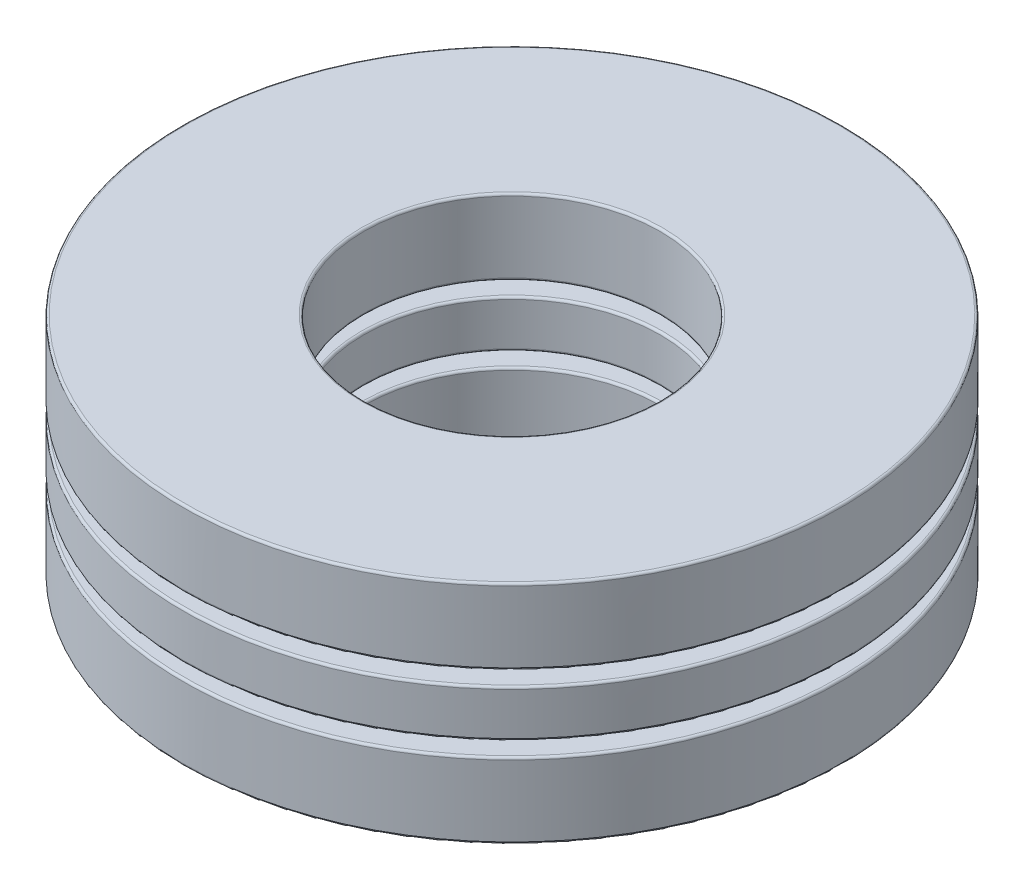
ISO-10303-21;
HEADER;
FILE_DESCRIPTION(('STEP AP214'),'2;1');
FILE_NAME('part.step','',(''),(''),'','','');
FILE_SCHEMA(('AUTOMOTIVE_DESIGN { 1 0 10303 214 1 1 1 1 }'));
ENDSEC;
DATA;
#1=APPLICATION_CONTEXT('core data for automotive mechanical design processes');
#2=APPLICATION_PROTOCOL_DEFINITION('international standard','automotive_design',2000,#1);
#3=PRODUCT_CONTEXT('',#1,'mechanical');
#4=PRODUCT('Part','Part','',(#3));
#5=PRODUCT_RELATED_PRODUCT_CATEGORY('part','',(#4));
#6=PRODUCT_DEFINITION_FORMATION('','',#4);
#7=PRODUCT_DEFINITION_CONTEXT('part definition',#1,'design');
#8=PRODUCT_DEFINITION('design','',#6,#7);
#9=PRODUCT_DEFINITION_SHAPE('','',#8);
#10=(LENGTH_UNIT() NAMED_UNIT(*) SI_UNIT(.MILLI.,.METRE.));
#11=(NAMED_UNIT(*) PLANE_ANGLE_UNIT() SI_UNIT($,.RADIAN.));
#12=(NAMED_UNIT(*) SI_UNIT($,.STERADIAN.) SOLID_ANGLE_UNIT());
#13=UNCERTAINTY_MEASURE_WITH_UNIT(LENGTH_MEASURE(1.E-05),#10,'distance_accuracy_value','');
#14=(GEOMETRIC_REPRESENTATION_CONTEXT(3) GLOBAL_UNCERTAINTY_ASSIGNED_CONTEXT((#13)) GLOBAL_UNIT_ASSIGNED_CONTEXT((#10,
#11,#12)) REPRESENTATION_CONTEXT('',''));
#15=CARTESIAN_POINT('',(0.,0.,0.));
#16=DIRECTION('',(0.,0.,1.));
#17=DIRECTION('',(1.,0.,0.));
#18=AXIS2_PLACEMENT_3D('',#15,#16,#17);
#19=CARTESIAN_POINT('',(0.,-2.4511,0.));
#20=DIRECTION('',(0.,-1.,0.));
#21=DIRECTION('',(0.,0.,-1.));
#22=AXIS2_PLACEMENT_3D('',#19,#20,#21);
#23=CYLINDRICAL_SURFACE('',#22,7.14375);
#24=CARTESIAN_POINT('',(0.,-2.402078,0.));
#25=DIRECTION('',(0.,1.,0.));
#26=DIRECTION('',(0.,0.,1.));
#27=AXIS2_PLACEMENT_3D('',#24,#25,#26);
#28=CIRCLE('',#27,7.14375);
#29=CARTESIAN_POINT('',(0.,-2.402078,7.14375));
#30=VERTEX_POINT('',#29);
#31=EDGE_CURVE('E11',#30,#30,#28,.T.);
#32=ORIENTED_EDGE('',*,*,#31,.T.);
#33=EDGE_LOOP('',(#32));
#34=FACE_BOUND('',#33,.T.);
#35=CARTESIAN_POINT('',(0.,-0.866055333333333,0.));
#36=DIRECTION('',(0.,-1.,0.));
#37=DIRECTION('',(0.,0.,-1.));
#38=AXIS2_PLACEMENT_3D('',#35,#36,#37);
#39=CIRCLE('',#38,7.14375);
#40=CARTESIAN_POINT('',(0.,-0.866055333333333,-7.14375));
#41=VERTEX_POINT('',#40);
#42=EDGE_CURVE('E49',#41,#41,#39,.T.);
#43=ORIENTED_EDGE('',*,*,#42,.T.);
#44=EDGE_LOOP('',(#43));
#45=FACE_BOUND('',#44,.T.);
#46=ADVANCED_FACE('F42',(#34,#45),#23,.T.);
#47=CARTESIAN_POINT('',(0.,-0.817033333333333,7.14375));
#48=DIRECTION('',(0.,-1.,0.));
#49=DIRECTION('',(0.,0.,-1.));
#50=AXIS2_PLACEMENT_3D('',#47,#48,#49);
#51=PLANE('',#50);
#52=CARTESIAN_POINT('',(0.,-0.817033333333333,0.));
#53=DIRECTION('',(0.,-1.,0.));
#54=DIRECTION('',(0.,0.,-1.));
#55=AXIS2_PLACEMENT_3D('',#52,#53,#54);
#56=CIRCLE('',#55,3.262122);
#57=CARTESIAN_POINT('',(0.,-0.817033333333333,-3.262122));
#58=VERTEX_POINT('',#57);
#59=EDGE_CURVE('E53',#58,#58,#56,.T.);
#60=ORIENTED_EDGE('',*,*,#59,.T.);
#61=EDGE_LOOP('',(#60));
#62=FACE_BOUND('',#61,.T.);
#63=CARTESIAN_POINT('',(0.,-0.817033333333333,0.));
#64=DIRECTION('',(0.,-1.,0.));
#65=DIRECTION('',(0.,0.,-1.));
#66=AXIS2_PLACEMENT_3D('',#63,#64,#65);
#67=CIRCLE('',#66,7.094728);
#68=CARTESIAN_POINT('',(0.,-0.817033333333333,-7.094728));
#69=VERTEX_POINT('',#68);
#70=EDGE_CURVE('E57',#69,#69,#67,.F.);
#71=ORIENTED_EDGE('',*,*,#70,.T.);
#72=EDGE_LOOP('',(#71));
#73=FACE_BOUND('',#72,.T.);
#74=ADVANCED_FACE('F85',(#62,#73),#51,.F.);
#75=CARTESIAN_POINT('',(0.,-2.4511,0.));
#76=DIRECTION('',(0.,-1.,0.));
#77=DIRECTION('',(0.,0.,-1.));
#78=AXIS2_PLACEMENT_3D('',#75,#76,#77);
#79=CYLINDRICAL_SURFACE('',#78,3.2131);
#80=CARTESIAN_POINT('',(0.,-2.402078,0.));
#81=DIRECTION('',(0.,1.,0.));
#82=DIRECTION('',(0.,0.,1.));
#83=AXIS2_PLACEMENT_3D('',#80,#81,#82);
#84=CIRCLE('',#83,3.2131);
#85=CARTESIAN_POINT('',(0.,-2.402078,3.2131));
#86=VERTEX_POINT('',#85);
#87=EDGE_CURVE('E68',#86,#86,#84,.F.);
#88=ORIENTED_EDGE('',*,*,#87,.T.);
#89=EDGE_LOOP('',(#88));
#90=FACE_BOUND('',#89,.T.);
#91=CARTESIAN_POINT('',(0.,-0.866055333333333,0.));
#92=DIRECTION('',(0.,-1.,0.));
#93=DIRECTION('',(0.,0.,-1.));
#94=AXIS2_PLACEMENT_3D('',#91,#92,#93);
#95=CIRCLE('',#94,3.2131);
#96=CARTESIAN_POINT('',(0.,-0.866055333333333,-3.2131));
#97=VERTEX_POINT('',#96);
#98=EDGE_CURVE('E71',#97,#97,#95,.F.);
#99=ORIENTED_EDGE('',*,*,#98,.T.);
#100=EDGE_LOOP('',(#99));
#101=FACE_BOUND('',#100,.T.);
#102=ADVANCED_FACE('F75',(#90,#101),#79,.F.);
#103=CARTESIAN_POINT('',(0.,-2.4511,7.14375));
#104=DIRECTION('',(0.,1.,0.));
#105=DIRECTION('',(0.,0.,1.));
#106=AXIS2_PLACEMENT_3D('',#103,#104,#105);
#107=PLANE('',#106);
#108=CARTESIAN_POINT('',(0.,-2.4511,0.));
#109=DIRECTION('',(0.,1.,0.));
#110=DIRECTION('',(0.,0.,1.));
#111=AXIS2_PLACEMENT_3D('',#108,#109,#110);
#112=CIRCLE('',#111,3.262122);
#113=CARTESIAN_POINT('',(0.,-2.4511,3.262122));
#114=VERTEX_POINT('',#113);
#115=EDGE_CURVE('E62',#114,#114,#112,.T.);
#116=ORIENTED_EDGE('',*,*,#115,.T.);
#117=EDGE_LOOP('',(#116));
#118=FACE_BOUND('',#117,.T.);
#119=CARTESIAN_POINT('',(0.,-2.4511,0.));
#120=DIRECTION('',(0.,1.,0.));
#121=DIRECTION('',(0.,0.,1.));
#122=AXIS2_PLACEMENT_3D('',#119,#120,#121);
#123=CIRCLE('',#122,7.094728);
#124=CARTESIAN_POINT('',(0.,-2.4511,7.094728));
#125=VERTEX_POINT('',#124);
#126=EDGE_CURVE('E65',#125,#125,#123,.F.);
#127=ORIENTED_EDGE('',*,*,#126,.T.);
#128=EDGE_LOOP('',(#127));
#129=FACE_BOUND('',#128,.T.);
#130=ADVANCED_FACE('F104',(#118,#129),#107,.F.);
#131=CARTESIAN_POINT('',(0.,-2.402078,0.));
#132=DIRECTION('',(0.,1.,0.));
#133=DIRECTION('',(0.,0.,1.));
#134=AXIS2_PLACEMENT_3D('',#131,#132,#133);
#135=TOROIDAL_SURFACE('',#134,3.262122,0.049022);
#136=ORIENTED_EDGE('',*,*,#115,.F.);
#137=EDGE_LOOP('',(#136));
#138=FACE_BOUND('',#137,.T.);
#139=ORIENTED_EDGE('',*,*,#87,.F.);
#140=EDGE_LOOP('',(#139));
#141=FACE_BOUND('',#140,.T.);
#142=ADVANCED_FACE('F81',(#138,#141),#135,.T.);
#143=CARTESIAN_POINT('',(0.,-0.866055333333333,0.));
#144=DIRECTION('',(0.,-1.,0.));
#145=DIRECTION('',(0.,0.,-1.));
#146=AXIS2_PLACEMENT_3D('',#143,#144,#145);
#147=TOROIDAL_SURFACE('',#146,3.262122,0.049022);
#148=ORIENTED_EDGE('',*,*,#98,.F.);
#149=EDGE_LOOP('',(#148));
#150=FACE_BOUND('',#149,.T.);
#151=ORIENTED_EDGE('',*,*,#59,.F.);
#152=EDGE_LOOP('',(#151));
#153=FACE_BOUND('',#152,.T.);
#154=ADVANCED_FACE('F77',(#150,#153),#147,.T.);
#155=CARTESIAN_POINT('',(0.,-2.402078,0.));
#156=DIRECTION('',(0.,1.,0.));
#157=DIRECTION('',(0.,0.,1.));
#158=AXIS2_PLACEMENT_3D('',#155,#156,#157);
#159=TOROIDAL_SURFACE('',#158,7.094728,0.049022);
#160=ORIENTED_EDGE('',*,*,#31,.F.);
#161=EDGE_LOOP('',(#160));
#162=FACE_BOUND('',#161,.T.);
#163=ORIENTED_EDGE('',*,*,#126,.F.);
#164=EDGE_LOOP('',(#163));
#165=FACE_BOUND('',#164,.T.);
#166=ADVANCED_FACE('F80',(#162,#165),#159,.T.);
#167=CARTESIAN_POINT('',(0.,-0.866055333333333,0.));
#168=DIRECTION('',(0.,-1.,0.));
#169=DIRECTION('',(0.,0.,-1.));
#170=AXIS2_PLACEMENT_3D('',#167,#168,#169);
#171=TOROIDAL_SURFACE('',#170,7.094728,0.049022);
#172=ORIENTED_EDGE('',*,*,#70,.F.);
#173=EDGE_LOOP('',(#172));
#174=FACE_BOUND('',#173,.T.);
#175=ORIENTED_EDGE('',*,*,#42,.F.);
#176=EDGE_LOOP('',(#175));
#177=FACE_BOUND('',#176,.T.);
#178=ADVANCED_FACE('F44',(#174,#177),#171,.T.);
#179=CLOSED_SHELL('',(#46,#74,#102,#130,#142,#154,#166,#178));
#180=MANIFOLD_SOLID_BREP('B2',#179);
#181=CARTESIAN_POINT('',(0.,-2.4511,0.));
#182=DIRECTION('',(0.,-1.,0.));
#183=DIRECTION('',(0.,0.,-1.));
#184=AXIS2_PLACEMENT_3D('',#181,#182,#183);
#185=CYLINDRICAL_SURFACE('',#184,7.14375);
#186=CARTESIAN_POINT('',(0.,0.866055333333334,0.));
#187=DIRECTION('',(0.,1.,0.));
#188=DIRECTION('',(0.,0.,1.));
#189=AXIS2_PLACEMENT_3D('',#186,#187,#188);
#190=CIRCLE('',#189,7.14375);
#191=CARTESIAN_POINT('',(0.,0.866055333333334,7.14375));
#192=VERTEX_POINT('',#191);
#193=EDGE_CURVE('E41',#192,#192,#190,.T.);
#194=ORIENTED_EDGE('',*,*,#193,.T.);
#195=EDGE_LOOP('',(#194));
#196=FACE_BOUND('',#195,.T.);
#197=CARTESIAN_POINT('',(0.,2.402078,0.));
#198=DIRECTION('',(0.,-1.,0.));
#199=DIRECTION('',(0.,0.,-1.));
#200=AXIS2_PLACEMENT_3D('',#197,#198,#199);
#201=CIRCLE('',#200,7.14375);
#202=CARTESIAN_POINT('',(0.,2.402078,-7.14375));
#203=VERTEX_POINT('',#202);
#204=EDGE_CURVE('E177',#203,#203,#201,.T.);
#205=ORIENTED_EDGE('',*,*,#204,.T.);
#206=EDGE_LOOP('',(#205));
#207=FACE_BOUND('',#206,.T.);
#208=ADVANCED_FACE('F170',(#196,#207),#185,.T.);
#209=CARTESIAN_POINT('',(0.,2.4511,7.14375));
#210=DIRECTION('',(0.,-1.,0.));
#211=DIRECTION('',(0.,0.,-1.));
#212=AXIS2_PLACEMENT_3D('',#209,#210,#211);
#213=PLANE('',#212);
#214=CARTESIAN_POINT('',(0.,2.4511,0.));
#215=DIRECTION('',(0.,-1.,0.));
#216=DIRECTION('',(0.,0.,-1.));
#217=AXIS2_PLACEMENT_3D('',#214,#215,#216);
#218=CIRCLE('',#217,3.262122);
#219=CARTESIAN_POINT('',(0.,2.4511,-3.262122));
#220=VERTEX_POINT('',#219);
#221=EDGE_CURVE('E181',#220,#220,#218,.T.);
#222=ORIENTED_EDGE('',*,*,#221,.T.);
#223=EDGE_LOOP('',(#222));
#224=FACE_BOUND('',#223,.T.);
#225=CARTESIAN_POINT('',(0.,2.4511,0.));
#226=DIRECTION('',(0.,-1.,0.));
#227=DIRECTION('',(0.,0.,-1.));
#228=AXIS2_PLACEMENT_3D('',#225,#226,#227);
#229=CIRCLE('',#228,7.094728);
#230=CARTESIAN_POINT('',(0.,2.4511,-7.094728));
#231=VERTEX_POINT('',#230);
#232=EDGE_CURVE('E185',#231,#231,#229,.F.);
#233=ORIENTED_EDGE('',*,*,#232,.T.);
#234=EDGE_LOOP('',(#233));
#235=FACE_BOUND('',#234,.T.);
#236=ADVANCED_FACE('F213',(#224,#235),#213,.F.);
#237=CARTESIAN_POINT('',(0.,-2.4511,0.));
#238=DIRECTION('',(0.,-1.,0.));
#239=DIRECTION('',(0.,0.,-1.));
#240=AXIS2_PLACEMENT_3D('',#237,#238,#239);
#241=CYLINDRICAL_SURFACE('',#240,3.2131);
#242=CARTESIAN_POINT('',(0.,0.866055333333334,0.));
#243=DIRECTION('',(0.,1.,0.));
#244=DIRECTION('',(0.,0.,1.));
#245=AXIS2_PLACEMENT_3D('',#242,#243,#244);
#246=CIRCLE('',#245,3.2131);
#247=CARTESIAN_POINT('',(0.,0.866055333333334,3.2131));
#248=VERTEX_POINT('',#247);
#249=EDGE_CURVE('E196',#248,#248,#246,.F.);
#250=ORIENTED_EDGE('',*,*,#249,.T.);
#251=EDGE_LOOP('',(#250));
#252=FACE_BOUND('',#251,.T.);
#253=CARTESIAN_POINT('',(0.,2.402078,0.));
#254=DIRECTION('',(0.,-1.,0.));
#255=DIRECTION('',(0.,0.,-1.));
#256=AXIS2_PLACEMENT_3D('',#253,#254,#255);
#257=CIRCLE('',#256,3.2131);
#258=CARTESIAN_POINT('',(0.,2.402078,-3.2131));
#259=VERTEX_POINT('',#258);
#260=EDGE_CURVE('E199',#259,#259,#257,.F.);
#261=ORIENTED_EDGE('',*,*,#260,.T.);
#262=EDGE_LOOP('',(#261));
#263=FACE_BOUND('',#262,.T.);
#264=ADVANCED_FACE('F203',(#252,#263),#241,.F.);
#265=CARTESIAN_POINT('',(0.,0.817033333333334,7.14375));
#266=DIRECTION('',(0.,1.,0.));
#267=DIRECTION('',(0.,0.,1.));
#268=AXIS2_PLACEMENT_3D('',#265,#266,#267);
#269=PLANE('',#268);
#270=CARTESIAN_POINT('',(0.,0.817033333333334,0.));
#271=DIRECTION('',(0.,1.,0.));
#272=DIRECTION('',(0.,0.,1.));
#273=AXIS2_PLACEMENT_3D('',#270,#271,#272);
#274=CIRCLE('',#273,3.262122);
#275=CARTESIAN_POINT('',(0.,0.817033333333334,3.262122));
#276=VERTEX_POINT('',#275);
#277=EDGE_CURVE('E190',#276,#276,#274,.T.);
#278=ORIENTED_EDGE('',*,*,#277,.T.);
#279=EDGE_LOOP('',(#278));
#280=FACE_BOUND('',#279,.T.);
#281=CARTESIAN_POINT('',(0.,0.817033333333334,0.));
#282=DIRECTION('',(0.,1.,0.));
#283=DIRECTION('',(0.,0.,1.));
#284=AXIS2_PLACEMENT_3D('',#281,#282,#283);
#285=CIRCLE('',#284,7.094728);
#286=CARTESIAN_POINT('',(0.,0.817033333333334,7.094728));
#287=VERTEX_POINT('',#286);
#288=EDGE_CURVE('E193',#287,#287,#285,.F.);
#289=ORIENTED_EDGE('',*,*,#288,.T.);
#290=EDGE_LOOP('',(#289));
#291=FACE_BOUND('',#290,.T.);
#292=ADVANCED_FACE('F232',(#280,#291),#269,.F.);
#293=CARTESIAN_POINT('',(0.,0.866055333333334,0.));
#294=DIRECTION('',(0.,1.,0.));
#295=DIRECTION('',(0.,0.,1.));
#296=AXIS2_PLACEMENT_3D('',#293,#294,#295);
#297=TOROIDAL_SURFACE('',#296,3.262122,0.049022);
#298=ORIENTED_EDGE('',*,*,#277,.F.);
#299=EDGE_LOOP('',(#298));
#300=FACE_BOUND('',#299,.T.);
#301=ORIENTED_EDGE('',*,*,#249,.F.);
#302=EDGE_LOOP('',(#301));
#303=FACE_BOUND('',#302,.T.);
#304=ADVANCED_FACE('F209',(#300,#303),#297,.T.);
#305=CARTESIAN_POINT('',(0.,2.402078,0.));
#306=DIRECTION('',(0.,-1.,0.));
#307=DIRECTION('',(0.,0.,-1.));
#308=AXIS2_PLACEMENT_3D('',#305,#306,#307);
#309=TOROIDAL_SURFACE('',#308,3.262122,0.049022);
#310=ORIENTED_EDGE('',*,*,#260,.F.);
#311=EDGE_LOOP('',(#310));
#312=FACE_BOUND('',#311,.T.);
#313=ORIENTED_EDGE('',*,*,#221,.F.);
#314=EDGE_LOOP('',(#313));
#315=FACE_BOUND('',#314,.T.);
#316=ADVANCED_FACE('F205',(#312,#315),#309,.T.);
#317=CARTESIAN_POINT('',(0.,0.866055333333334,0.));
#318=DIRECTION('',(0.,1.,0.));
#319=DIRECTION('',(0.,0.,1.));
#320=AXIS2_PLACEMENT_3D('',#317,#318,#319);
#321=TOROIDAL_SURFACE('',#320,7.094728,0.049022);
#322=ORIENTED_EDGE('',*,*,#193,.F.);
#323=EDGE_LOOP('',(#322));
#324=FACE_BOUND('',#323,.T.);
#325=ORIENTED_EDGE('',*,*,#288,.F.);
#326=EDGE_LOOP('',(#325));
#327=FACE_BOUND('',#326,.T.);
#328=ADVANCED_FACE('F208',(#324,#327),#321,.T.);
#329=CARTESIAN_POINT('',(0.,2.402078,0.));
#330=DIRECTION('',(0.,-1.,0.));
#331=DIRECTION('',(0.,0.,-1.));
#332=AXIS2_PLACEMENT_3D('',#329,#330,#331);
#333=TOROIDAL_SURFACE('',#332,7.094728,0.049022);
#334=ORIENTED_EDGE('',*,*,#232,.F.);
#335=EDGE_LOOP('',(#334));
#336=FACE_BOUND('',#335,.T.);
#337=ORIENTED_EDGE('',*,*,#204,.F.);
#338=EDGE_LOOP('',(#337));
#339=FACE_BOUND('',#338,.T.);
#340=ADVANCED_FACE('F172',(#336,#339),#333,.T.);
#341=CLOSED_SHELL('',(#208,#236,#264,#292,#304,#316,#328,#340));
#342=MANIFOLD_SOLID_BREP('B6',#341);
#343=CARTESIAN_POINT('',(-4.48464760159246,0.,-2.58921249999996));
#344=DIRECTION('',(0.,1.,0.));
#345=DIRECTION('',(0.866025403784443,0.,0.499999999999992));
#346=AXIS2_PLACEMENT_3D('',#343,#344,#345);
#347=SPHERICAL_SURFACE('',#346,0.817033333333333);
#348=CARTESIAN_POINT('',(-4.48464760159246,0.817033333333333,-2.58921249999996));
#349=VERTEX_POINT('',#348);
#350=VERTEX_LOOP('',#349);
#351=FACE_BOUND('',#350,.T.);
#352=ADVANCED_FACE('F298',(#351),#347,.T.);
#353=CLOSED_SHELL('',(#352));
#354=MANIFOLD_SOLID_BREP('B36',#353);
#355=CARTESIAN_POINT('',(4.48464760159242,0.,-2.58921250000002));
#356=DIRECTION('',(0.,1.,0.));
#357=DIRECTION('',(-0.866025403784436,0.,0.500000000000004));
#358=AXIS2_PLACEMENT_3D('',#355,#356,#357);
#359=SPHERICAL_SURFACE('',#358,0.817033333333333);
#360=CARTESIAN_POINT('',(4.48464760159242,0.817033333333333,-2.58921250000002));
#361=VERTEX_POINT('',#360);
#362=VERTEX_LOOP('',#361);
#363=FACE_BOUND('',#362,.T.);
#364=ADVANCED_FACE('F317',(#363),#359,.T.);
#365=CLOSED_SHELL('',(#364));
#366=MANIFOLD_SOLID_BREP('B166',#365);
#367=CARTESIAN_POINT('',(0.,0.,5.178425));
#368=DIRECTION('',(0.,1.,0.));
#369=DIRECTION('',(0.,0.,-1.));
#370=AXIS2_PLACEMENT_3D('',#367,#368,#369);
#371=SPHERICAL_SURFACE('',#370,0.817033333333333);
#372=CARTESIAN_POINT('',(0.,0.817033333333333,5.178425));
#373=VERTEX_POINT('',#372);
#374=VERTEX_LOOP('',#373);
#375=FACE_BOUND('',#374,.T.);
#376=ADVANCED_FACE('F337',(#375),#371,.T.);
#377=CLOSED_SHELL('',(#376));
#378=MANIFOLD_SOLID_BREP('B294',#377);
#379=CARTESIAN_POINT('',(0.,-2.4511,0.));
#380=DIRECTION('',(0.,-1.,0.));
#381=DIRECTION('',(0.,0.,-1.));
#382=AXIS2_PLACEMENT_3D('',#379,#380,#381);
#383=CYLINDRICAL_SURFACE('',#382,7.14375);
#384=CARTESIAN_POINT('',(0.,-0.461623833333335,0.));
#385=DIRECTION('',(0.,1.,0.));
#386=DIRECTION('',(0.,0.,1.));
#387=AXIS2_PLACEMENT_3D('',#384,#385,#386);
#388=CIRCLE('',#387,7.14375);
#389=CARTESIAN_POINT('',(0.,-0.461623833333335,7.14375));
#390=VERTEX_POINT('',#389);
#391=EDGE_CURVE('E336',#390,#390,#388,.T.);
#392=ORIENTED_EDGE('',*,*,#391,.T.);
#393=EDGE_LOOP('',(#392));
#394=FACE_BOUND('',#393,.T.);
#395=CARTESIAN_POINT('',(0.,0.461623833333332,0.));
#396=DIRECTION('',(0.,-1.,0.));
#397=DIRECTION('',(0.,0.,-1.));
#398=AXIS2_PLACEMENT_3D('',#395,#396,#397);
#399=CIRCLE('',#398,7.14375);
#400=CARTESIAN_POINT('',(0.,0.461623833333332,-7.14375));
#401=VERTEX_POINT('',#400);
#402=EDGE_CURVE('E357',#401,#401,#399,.T.);
#403=ORIENTED_EDGE('',*,*,#402,.T.);
#404=EDGE_LOOP('',(#403));
#405=FACE_BOUND('',#404,.T.);
#406=ADVANCED_FACE('F350',(#394,#405),#383,.T.);
#407=CARTESIAN_POINT('',(0.,-0.510645833333335,7.14375));
#408=DIRECTION('',(0.,1.,0.));
#409=DIRECTION('',(0.,0.,1.));
#410=AXIS2_PLACEMENT_3D('',#407,#408,#409);
#411=PLANE('',#410);
#412=CARTESIAN_POINT('',(0.,-0.510645833333335,0.));
#413=DIRECTION('',(0.,1.,0.));
#414=DIRECTION('',(0.,0.,1.));
#415=AXIS2_PLACEMENT_3D('',#412,#413,#414);
#416=CIRCLE('',#415,3.262122);
#417=CARTESIAN_POINT('',(0.,-0.510645833333335,3.262122));
#418=VERTEX_POINT('',#417);
#419=EDGE_CURVE('E370',#418,#418,#416,.T.);
#420=ORIENTED_EDGE('',*,*,#419,.T.);
#421=EDGE_LOOP('',(#420));
#422=FACE_BOUND('',#421,.T.);
#423=CARTESIAN_POINT('',(0.,-0.510645833333335,0.));
#424=DIRECTION('',(0.,1.,0.));
#425=DIRECTION('',(0.,0.,1.));
#426=AXIS2_PLACEMENT_3D('',#423,#424,#425);
#427=CIRCLE('',#426,7.094728);
#428=CARTESIAN_POINT('',(0.,-0.510645833333335,7.094728));
#429=VERTEX_POINT('',#428);
#430=EDGE_CURVE('E373',#429,#429,#427,.F.);
#431=ORIENTED_EDGE('',*,*,#430,.T.);
#432=EDGE_LOOP('',(#431));
#433=FACE_BOUND('',#432,.T.);
#434=CARTESIAN_POINT('',(-4.48464760159246,-0.510645833333335,-2.58921249999996));
#435=DIRECTION('',(0.,1.,0.));
#436=DIRECTION('',(-0.866025403784443,0.,-0.499999999999992));
#437=AXIS2_PLACEMENT_3D('',#434,#435,#436);
#438=CIRCLE('',#437,0.637796441411429);
#439=CARTESIAN_POINT('',(-5.03699552229807,-0.510645833333335,-2.90811072070567));
#440=VERTEX_POINT('',#439);
#441=EDGE_CURVE('E394',#440,#440,#438,.T.);
#442=ORIENTED_EDGE('',*,*,#441,.T.);
#443=EDGE_LOOP('',(#442));
#444=FACE_BOUND('',#443,.T.);
#445=CARTESIAN_POINT('',(4.48464760159242,-0.510645833333335,-2.58921250000002));
#446=DIRECTION('',(0.,1.,0.));
#447=DIRECTION('',(0.866025403784436,0.,-0.500000000000004));
#448=AXIS2_PLACEMENT_3D('',#445,#446,#447);
#449=CIRCLE('',#448,0.637796441411429);
#450=CARTESIAN_POINT('',(5.03699552229803,-0.510645833333335,-2.90811072070574));
#451=VERTEX_POINT('',#450);
#452=EDGE_CURVE('E386',#451,#451,#449,.T.);
#453=ORIENTED_EDGE('',*,*,#452,.T.);
#454=EDGE_LOOP('',(#453));
#455=FACE_BOUND('',#454,.T.);
#456=CARTESIAN_POINT('',(0.,-0.510645833333335,5.178425));
#457=DIRECTION('',(0.,1.,0.));
#458=DIRECTION('',(0.,0.,1.));
#459=AXIS2_PLACEMENT_3D('',#456,#457,#458);
#460=CIRCLE('',#459,0.637796441411429);
#461=CARTESIAN_POINT('',(0.,-0.510645833333335,5.81622144141143));
#462=VERTEX_POINT('',#461);
#463=EDGE_CURVE('E382',#462,#462,#460,.T.);
#464=ORIENTED_EDGE('',*,*,#463,.T.);
#465=EDGE_LOOP('',(#464));
#466=FACE_BOUND('',#465,.T.);
#467=ADVANCED_FACE('F412',(#422,#433,#444,#455,#466),#411,.F.);
#468=CARTESIAN_POINT('',(0.,-2.4511,0.));
#469=DIRECTION('',(0.,-1.,0.));
#470=DIRECTION('',(0.,0.,-1.));
#471=AXIS2_PLACEMENT_3D('',#468,#469,#470);
#472=CYLINDRICAL_SURFACE('',#471,3.2131);
#473=CARTESIAN_POINT('',(0.,-0.461623833333335,0.));
#474=DIRECTION('',(0.,1.,0.));
#475=DIRECTION('',(0.,0.,1.));
#476=AXIS2_PLACEMENT_3D('',#473,#474,#475);
#477=CIRCLE('',#476,3.2131);
#478=CARTESIAN_POINT('',(0.,-0.461623833333335,3.2131));
#479=VERTEX_POINT('',#478);
#480=EDGE_CURVE('E376',#479,#479,#477,.F.);
#481=ORIENTED_EDGE('',*,*,#480,.T.);
#482=EDGE_LOOP('',(#481));
#483=FACE_BOUND('',#482,.T.);
#484=CARTESIAN_POINT('',(0.,0.461623833333332,0.));
#485=DIRECTION('',(0.,-1.,0.));
#486=DIRECTION('',(0.,0.,-1.));
#487=AXIS2_PLACEMENT_3D('',#484,#485,#486);
#488=CIRCLE('',#487,3.2131);
#489=CARTESIAN_POINT('',(0.,0.461623833333332,-3.2131));
#490=VERTEX_POINT('',#489);
#491=EDGE_CURVE('E379',#490,#490,#488,.F.);
#492=ORIENTED_EDGE('',*,*,#491,.T.);
#493=EDGE_LOOP('',(#492));
#494=FACE_BOUND('',#493,.T.);
#495=ADVANCED_FACE('F415',(#483,#494),#472,.F.);
#496=CARTESIAN_POINT('',(0.,0.510645833333332,7.14375));
#497=DIRECTION('',(0.,-1.,0.));
#498=DIRECTION('',(0.,0.,-1.));
#499=AXIS2_PLACEMENT_3D('',#496,#497,#498);
#500=PLANE('',#499);
#501=CARTESIAN_POINT('',(0.,0.510645833333332,0.));
#502=DIRECTION('',(0.,-1.,0.));
#503=DIRECTION('',(0.,0.,-1.));
#504=AXIS2_PLACEMENT_3D('',#501,#502,#503);
#505=CIRCLE('',#504,3.262122);
#506=CARTESIAN_POINT('',(0.,0.510645833333332,-3.262122));
#507=VERTEX_POINT('',#506);
#508=EDGE_CURVE('E361',#507,#507,#505,.T.);
#509=ORIENTED_EDGE('',*,*,#508,.T.);
#510=EDGE_LOOP('',(#509));
#511=FACE_BOUND('',#510,.T.);
#512=CARTESIAN_POINT('',(0.,0.510645833333332,0.));
#513=DIRECTION('',(0.,-1.,0.));
#514=DIRECTION('',(0.,0.,-1.));
#515=AXIS2_PLACEMENT_3D('',#512,#513,#514);
#516=CIRCLE('',#515,7.094728);
#517=CARTESIAN_POINT('',(0.,0.510645833333332,-7.094728));
#518=VERTEX_POINT('',#517);
#519=EDGE_CURVE('E365',#518,#518,#516,.F.);
#520=ORIENTED_EDGE('',*,*,#519,.T.);
#521=EDGE_LOOP('',(#520));
#522=FACE_BOUND('',#521,.T.);
#523=CARTESIAN_POINT('',(-4.48464760159246,0.510645833333332,-2.58921249999996));
#524=DIRECTION('',(0.,-1.,0.));
#525=DIRECTION('',(0.866025403784443,0.,0.499999999999992));
#526=AXIS2_PLACEMENT_3D('',#523,#524,#525);
#527=CIRCLE('',#526,0.637796441411431);
#528=CARTESIAN_POINT('',(-3.93229968088684,0.510645833333332,-2.27031427929425));
#529=VERTEX_POINT('',#528);
#530=EDGE_CURVE('E397',#529,#529,#527,.T.);
#531=ORIENTED_EDGE('',*,*,#530,.T.);
#532=EDGE_LOOP('',(#531));
#533=FACE_BOUND('',#532,.T.);
#534=CARTESIAN_POINT('',(4.48464760159242,0.510645833333332,-2.58921250000002));
#535=DIRECTION('',(0.,-1.,0.));
#536=DIRECTION('',(-0.866025403784436,0.,0.500000000000004));
#537=AXIS2_PLACEMENT_3D('',#534,#535,#536);
#538=CIRCLE('',#537,0.637796441411431);
#539=CARTESIAN_POINT('',(3.93229968088681,0.510645833333332,-2.2703142792943));
#540=VERTEX_POINT('',#539);
#541=EDGE_CURVE('E391',#540,#540,#538,.T.);
#542=ORIENTED_EDGE('',*,*,#541,.T.);
#543=EDGE_LOOP('',(#542));
#544=FACE_BOUND('',#543,.T.);
#545=CARTESIAN_POINT('',(0.,0.510645833333332,5.178425));
#546=DIRECTION('',(0.,-1.,0.));
#547=DIRECTION('',(0.,0.,-1.));
#548=AXIS2_PLACEMENT_3D('',#545,#546,#547);
#549=CIRCLE('',#548,0.637796441411431);
#550=CARTESIAN_POINT('',(0.,0.510645833333332,4.54062855858857));
#551=VERTEX_POINT('',#550);
#552=EDGE_CURVE('E383',#551,#551,#549,.T.);
#553=ORIENTED_EDGE('',*,*,#552,.T.);
#554=EDGE_LOOP('',(#553));
#555=FACE_BOUND('',#554,.T.);
#556=ADVANCED_FACE('F401',(#511,#522,#533,#544,#555),#500,.F.);
#557=CARTESIAN_POINT('',(0.,0.,5.178425));
#558=DIRECTION('',(0.,1.,0.));
#559=DIRECTION('',(0.,0.,-1.));
#560=AXIS2_PLACEMENT_3D('',#557,#558,#559);
#561=SPHERICAL_SURFACE('',#560,0.817033333333333);
#562=ORIENTED_EDGE('',*,*,#552,.F.);
#563=EDGE_LOOP('',(#562));
#564=FACE_BOUND('',#563,.T.);
#565=ORIENTED_EDGE('',*,*,#463,.F.);
#566=EDGE_LOOP('',(#565));
#567=FACE_BOUND('',#566,.T.);
#568=ADVANCED_FACE('F422',(#564,#567),#561,.F.);
#569=CARTESIAN_POINT('',(4.48464760159242,0.,-2.58921250000002));
#570=DIRECTION('',(0.,1.,0.));
#571=DIRECTION('',(-0.866025403784436,0.,0.500000000000004));
#572=AXIS2_PLACEMENT_3D('',#569,#570,#571);
#573=SPHERICAL_SURFACE('',#572,0.817033333333333);
#574=ORIENTED_EDGE('',*,*,#541,.F.);
#575=EDGE_LOOP('',(#574));
#576=FACE_BOUND('',#575,.T.);
#577=ORIENTED_EDGE('',*,*,#452,.F.);
#578=EDGE_LOOP('',(#577));
#579=FACE_BOUND('',#578,.T.);
#580=ADVANCED_FACE('F408',(#576,#579),#573,.F.);
#581=CARTESIAN_POINT('',(-4.48464760159246,0.,-2.58921249999996));
#582=DIRECTION('',(0.,1.,0.));
#583=DIRECTION('',(0.866025403784443,0.,0.499999999999992));
#584=AXIS2_PLACEMENT_3D('',#581,#582,#583);
#585=SPHERICAL_SURFACE('',#584,0.817033333333333);
#586=ORIENTED_EDGE('',*,*,#530,.F.);
#587=EDGE_LOOP('',(#586));
#588=FACE_BOUND('',#587,.T.);
#589=ORIENTED_EDGE('',*,*,#441,.F.);
#590=EDGE_LOOP('',(#589));
#591=FACE_BOUND('',#590,.T.);
#592=ADVANCED_FACE('F404',(#588,#591),#585,.F.);
#593=CARTESIAN_POINT('',(0.,-0.461623833333335,0.));
#594=DIRECTION('',(0.,1.,0.));
#595=DIRECTION('',(0.,0.,1.));
#596=AXIS2_PLACEMENT_3D('',#593,#594,#595);
#597=TOROIDAL_SURFACE('',#596,3.262122,0.049022);
#598=ORIENTED_EDGE('',*,*,#419,.F.);
#599=EDGE_LOOP('',(#598));
#600=FACE_BOUND('',#599,.T.);
#601=ORIENTED_EDGE('',*,*,#480,.F.);
#602=EDGE_LOOP('',(#601));
#603=FACE_BOUND('',#602,.T.);
#604=ADVANCED_FACE('F407',(#600,#603),#597,.T.);
#605=CARTESIAN_POINT('',(0.,0.461623833333332,0.));
#606=DIRECTION('',(0.,-1.,0.));
#607=DIRECTION('',(0.,0.,-1.));
#608=AXIS2_PLACEMENT_3D('',#605,#606,#607);
#609=TOROIDAL_SURFACE('',#608,3.262122,0.049022);
#610=ORIENTED_EDGE('',*,*,#491,.F.);
#611=EDGE_LOOP('',(#610));
#612=FACE_BOUND('',#611,.T.);
#613=ORIENTED_EDGE('',*,*,#508,.F.);
#614=EDGE_LOOP('',(#613));
#615=FACE_BOUND('',#614,.T.);
#616=ADVANCED_FACE('F443',(#612,#615),#609,.T.);
#617=CARTESIAN_POINT('',(0.,-0.461623833333335,0.));
#618=DIRECTION('',(0.,1.,0.));
#619=DIRECTION('',(0.,0.,1.));
#620=AXIS2_PLACEMENT_3D('',#617,#618,#619);
#621=TOROIDAL_SURFACE('',#620,7.094728,0.049022);
#622=ORIENTED_EDGE('',*,*,#391,.F.);
#623=EDGE_LOOP('',(#622));
#624=FACE_BOUND('',#623,.T.);
#625=ORIENTED_EDGE('',*,*,#430,.F.);
#626=EDGE_LOOP('',(#625));
#627=FACE_BOUND('',#626,.T.);
#628=ADVANCED_FACE('F446',(#624,#627),#621,.T.);
#629=CARTESIAN_POINT('',(0.,0.461623833333332,0.));
#630=DIRECTION('',(0.,-1.,0.));
#631=DIRECTION('',(0.,0.,-1.));
#632=AXIS2_PLACEMENT_3D('',#629,#630,#631);
#633=TOROIDAL_SURFACE('',#632,7.094728,0.049022);
#634=ORIENTED_EDGE('',*,*,#519,.F.);
#635=EDGE_LOOP('',(#634));
#636=FACE_BOUND('',#635,.T.);
#637=ORIENTED_EDGE('',*,*,#402,.F.);
#638=EDGE_LOOP('',(#637));
#639=FACE_BOUND('',#638,.T.);
#640=ADVANCED_FACE('F352',(#636,#639),#633,.T.);
#641=CLOSED_SHELL('',(#406,#467,#495,#556,#568,#580,#592,#604,#616,#628,#640));
#642=MANIFOLD_SOLID_BREP('B313',#641);
#643=ADVANCED_BREP_SHAPE_REPRESENTATION('',(#18,#180,#342,#354,#366,#378,#642),#14);
#644=SHAPE_DEFINITION_REPRESENTATION(#9,#643);
ENDSEC;
END-ISO-10303-21;
